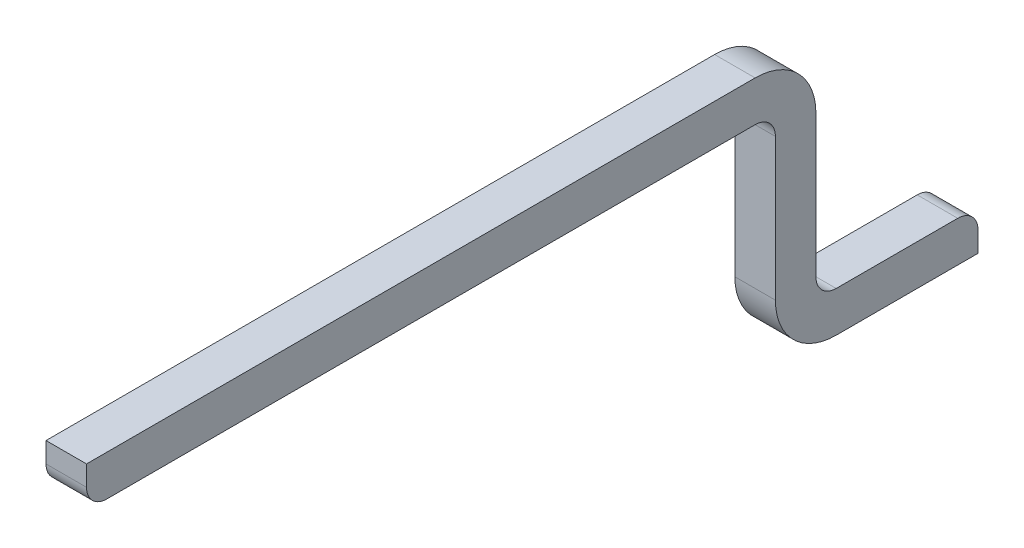
ISO-10303-21;
HEADER;
FILE_DESCRIPTION(('STEP AP214'),'2;1');
FILE_NAME('part.step','',(''),(''),'','','');
FILE_SCHEMA(('AUTOMOTIVE_DESIGN { 1 0 10303 214 1 1 1 1 }'));
ENDSEC;
DATA;
#1=APPLICATION_CONTEXT('core data for automotive mechanical design processes');
#2=APPLICATION_PROTOCOL_DEFINITION('international standard','automotive_design',2000,#1);
#3=PRODUCT_CONTEXT('',#1,'mechanical');
#4=PRODUCT('Part','Part','',(#3));
#5=PRODUCT_RELATED_PRODUCT_CATEGORY('part','',(#4));
#6=PRODUCT_DEFINITION_FORMATION('','',#4);
#7=PRODUCT_DEFINITION_CONTEXT('part definition',#1,'design');
#8=PRODUCT_DEFINITION('design','',#6,#7);
#9=PRODUCT_DEFINITION_SHAPE('','',#8);
#10=(LENGTH_UNIT() NAMED_UNIT(*) SI_UNIT(.MILLI.,.METRE.));
#11=(NAMED_UNIT(*) PLANE_ANGLE_UNIT() SI_UNIT($,.RADIAN.));
#12=(NAMED_UNIT(*) SI_UNIT($,.STERADIAN.) SOLID_ANGLE_UNIT());
#13=UNCERTAINTY_MEASURE_WITH_UNIT(LENGTH_MEASURE(1.E-05),#10,'distance_accuracy_value','');
#14=(GEOMETRIC_REPRESENTATION_CONTEXT(3) GLOBAL_UNCERTAINTY_ASSIGNED_CONTEXT((#13)) GLOBAL_UNIT_ASSIGNED_CONTEXT((#10,
#11,#12)) REPRESENTATION_CONTEXT('',''));
#15=CARTESIAN_POINT('',(0.,0.,0.));
#16=DIRECTION('',(0.,0.,1.));
#17=DIRECTION('',(1.,0.,0.));
#18=AXIS2_PLACEMENT_3D('',#15,#16,#17);
#19=CARTESIAN_POINT('',(0.1,0.,-4.5));
#20=DIRECTION('',(0.,1.,0.));
#21=DIRECTION('',(0.,0.,1.));
#22=AXIS2_PLACEMENT_3D('',#19,#20,#21);
#23=PLANE('',#22);
#24=DIRECTION('',(0.,0.,-1.));
#25=VECTOR('',#24,1.);
#26=CARTESIAN_POINT('',(-0.1,0.,-4.5));
#27=LINE('',#26,#25);
#28=CARTESIAN_POINT('',(-0.1,0.,-4.5));
#29=VERTEX_POINT('',#28);
#30=CARTESIAN_POINT('',(-0.1,0.,-5.2));
#31=VERTEX_POINT('',#30);
#32=EDGE_CURVE('E155',#29,#31,#27,.T.);
#33=ORIENTED_EDGE('',*,*,#32,.T.);
#34=DIRECTION('',(-1.,0.,0.));
#35=VECTOR('',#34,1.);
#36=CARTESIAN_POINT('',(0.1,0.,-5.2));
#37=LINE('',#36,#35);
#38=CARTESIAN_POINT('',(0.1,0.,-5.2));
#39=VERTEX_POINT('',#38);
#40=EDGE_CURVE('E137',#39,#31,#37,.T.);
#41=ORIENTED_EDGE('',*,*,#40,.F.);
#42=DIRECTION('',(0.,0.,-1.));
#43=VECTOR('',#42,1.);
#44=CARTESIAN_POINT('',(0.1,0.,-4.5));
#45=LINE('',#44,#43);
#46=CARTESIAN_POINT('',(0.1,0.,-4.5));
#47=VERTEX_POINT('',#46);
#48=EDGE_CURVE('E143',#47,#39,#45,.T.);
#49=ORIENTED_EDGE('',*,*,#48,.F.);
#50=DIRECTION('',(-1.,0.,0.));
#51=VECTOR('',#50,1.);
#52=CARTESIAN_POINT('',(0.1,0.,-4.5));
#53=LINE('',#52,#51);
#54=EDGE_CURVE('E198',#47,#29,#53,.T.);
#55=ORIENTED_EDGE('',*,*,#54,.T.);
#56=EDGE_LOOP('',(#33,#41,#49,#55));
#57=FACE_BOUND('',#56,.T.);
#58=ADVANCED_FACE('F32',(#57),#23,.F.);
#59=CARTESIAN_POINT('',(0.1,0.2,-5.2));
#60=DIRECTION('',(0.,0.,-1.));
#61=DIRECTION('',(-1.,0.,0.));
#62=AXIS2_PLACEMENT_3D('',#59,#60,#61);
#63=PLANE('',#62);
#64=DIRECTION('',(0.,-1.,0.));
#65=VECTOR('',#64,1.);
#66=CARTESIAN_POINT('',(-0.1,0.2,-5.2));
#67=LINE('',#66,#65);
#68=CARTESIAN_POINT('',(-0.1,0.1,-5.2));
#69=VERTEX_POINT('',#68);
#70=EDGE_CURVE('E268',#69,#31,#67,.T.);
#71=ORIENTED_EDGE('',*,*,#70,.F.);
#72=DIRECTION('',(-1.,0.,0.));
#73=VECTOR('',#72,1.);
#74=CARTESIAN_POINT('',(0.1,0.1,-5.2));
#75=LINE('',#74,#73);
#76=CARTESIAN_POINT('',(0.1,0.1,-5.2));
#77=VERTEX_POINT('',#76);
#78=EDGE_CURVE('E140',#69,#77,#75,.F.);
#79=ORIENTED_EDGE('',*,*,#78,.T.);
#80=DIRECTION('',(0.,-1.,0.));
#81=VECTOR('',#80,1.);
#82=CARTESIAN_POINT('',(0.1,0.2,-5.2));
#83=LINE('',#82,#81);
#84=EDGE_CURVE('E132',#77,#39,#83,.T.);
#85=ORIENTED_EDGE('',*,*,#84,.T.);
#86=ORIENTED_EDGE('',*,*,#40,.T.);
#87=EDGE_LOOP('',(#71,#79,#85,#86));
#88=FACE_BOUND('',#87,.T.);
#89=ADVANCED_FACE('F135',(#88),#63,.T.);
#90=CARTESIAN_POINT('',(0.1,0.2,-4.5));
#91=DIRECTION('',(0.,1.,0.));
#92=DIRECTION('',(0.,0.,1.));
#93=AXIS2_PLACEMENT_3D('',#90,#91,#92);
#94=PLANE('',#93);
#95=DIRECTION('',(0.,0.,-1.));
#96=VECTOR('',#95,1.);
#97=CARTESIAN_POINT('',(0.1,0.2,-4.5));
#98=LINE('',#97,#96);
#99=CARTESIAN_POINT('',(0.1,0.2,-4.5));
#100=VERTEX_POINT('',#99);
#101=CARTESIAN_POINT('',(0.1,0.2,-5.1));
#102=VERTEX_POINT('',#101);
#103=EDGE_CURVE('E142',#100,#102,#98,.T.);
#104=ORIENTED_EDGE('',*,*,#103,.T.);
#105=DIRECTION('',(-1.,0.,0.));
#106=VECTOR('',#105,1.);
#107=CARTESIAN_POINT('',(0.1,0.2,-5.1));
#108=LINE('',#107,#106);
#109=CARTESIAN_POINT('',(-0.1,0.2,-5.1));
#110=VERTEX_POINT('',#109);
#111=EDGE_CURVE('E156',#102,#110,#108,.T.);
#112=ORIENTED_EDGE('',*,*,#111,.T.);
#113=DIRECTION('',(0.,0.,-1.));
#114=VECTOR('',#113,1.);
#115=CARTESIAN_POINT('',(-0.1,0.2,-4.5));
#116=LINE('',#115,#114);
#117=CARTESIAN_POINT('',(-0.1,0.2,-4.5));
#118=VERTEX_POINT('',#117);
#119=EDGE_CURVE('E231',#118,#110,#116,.T.);
#120=ORIENTED_EDGE('',*,*,#119,.F.);
#121=DIRECTION('',(-1.,0.,0.));
#122=VECTOR('',#121,1.);
#123=CARTESIAN_POINT('',(0.1,0.2,-4.5));
#124=LINE('',#123,#122);
#125=EDGE_CURVE('E157',#100,#118,#124,.T.);
#126=ORIENTED_EDGE('',*,*,#125,.F.);
#127=EDGE_LOOP('',(#104,#112,#120,#126));
#128=FACE_BOUND('',#127,.T.);
#129=ADVANCED_FACE('F271',(#128),#94,.T.);
#130=CARTESIAN_POINT('',(0.1,0.3,-4.5));
#131=DIRECTION('',(-1.,0.,0.));
#132=DIRECTION('',(0.,0.,1.));
#133=AXIS2_PLACEMENT_3D('',#130,#131,#132);
#134=CYLINDRICAL_SURFACE('',#133,0.0999999999999999);
#135=CARTESIAN_POINT('',(-0.1,0.3,-4.5));
#136=DIRECTION('',(1.,0.,0.));
#137=DIRECTION('',(0.,0.,-1.));
#138=AXIS2_PLACEMENT_3D('',#135,#136,#137);
#139=CIRCLE('',#138,0.0999999999999999);
#140=CARTESIAN_POINT('',(-0.1,0.3,-4.4));
#141=VERTEX_POINT('',#140);
#142=EDGE_CURVE('E228',#141,#118,#139,.T.);
#143=ORIENTED_EDGE('',*,*,#142,.F.);
#144=DIRECTION('',(-1.,0.,0.));
#145=VECTOR('',#144,1.);
#146=CARTESIAN_POINT('',(0.1,0.3,-4.4));
#147=LINE('',#146,#145);
#148=CARTESIAN_POINT('',(0.1,0.3,-4.4));
#149=VERTEX_POINT('',#148);
#150=EDGE_CURVE('E162',#149,#141,#147,.T.);
#151=ORIENTED_EDGE('',*,*,#150,.F.);
#152=CARTESIAN_POINT('',(0.1,0.3,-4.5));
#153=DIRECTION('',(1.,0.,0.));
#154=DIRECTION('',(0.,0.,-1.));
#155=AXIS2_PLACEMENT_3D('',#152,#153,#154);
#156=CIRCLE('',#155,0.0999999999999999);
#157=EDGE_CURVE('E252',#149,#100,#156,.T.);
#158=ORIENTED_EDGE('',*,*,#157,.T.);
#159=ORIENTED_EDGE('',*,*,#125,.T.);
#160=EDGE_LOOP('',(#143,#151,#158,#159));
#161=FACE_BOUND('',#160,.T.);
#162=ADVANCED_FACE('F229',(#161),#134,.F.);
#163=CARTESIAN_POINT('',(0.1,1.,-4.4));
#164=DIRECTION('',(0.,0.,-1.));
#165=DIRECTION('',(-1.,0.,0.));
#166=AXIS2_PLACEMENT_3D('',#163,#164,#165);
#167=PLANE('',#166);
#168=DIRECTION('',(0.,1.,0.));
#169=VECTOR('',#168,1.);
#170=CARTESIAN_POINT('',(-0.1,1.,-4.4));
#171=LINE('',#170,#169);
#172=CARTESIAN_POINT('',(-0.1,1.,-4.4));
#173=VERTEX_POINT('',#172);
#174=EDGE_CURVE('E220',#173,#141,#171,.F.);
#175=ORIENTED_EDGE('',*,*,#174,.F.);
#176=DIRECTION('',(-1.,0.,0.));
#177=VECTOR('',#176,1.);
#178=CARTESIAN_POINT('',(0.1,1.,-4.4));
#179=LINE('',#178,#177);
#180=CARTESIAN_POINT('',(0.1,1.,-4.4));
#181=VERTEX_POINT('',#180);
#182=EDGE_CURVE('E213',#181,#173,#179,.T.);
#183=ORIENTED_EDGE('',*,*,#182,.F.);
#184=DIRECTION('',(0.,1.,0.));
#185=VECTOR('',#184,1.);
#186=CARTESIAN_POINT('',(0.1,1.,-4.4));
#187=LINE('',#186,#185);
#188=EDGE_CURVE('E223',#181,#149,#187,.F.);
#189=ORIENTED_EDGE('',*,*,#188,.T.);
#190=ORIENTED_EDGE('',*,*,#150,.T.);
#191=EDGE_LOOP('',(#175,#183,#189,#190));
#192=FACE_BOUND('',#191,.T.);
#193=ADVANCED_FACE('F218',(#192),#167,.T.);
#194=CARTESIAN_POINT('',(0.1,1.,-4.1));
#195=DIRECTION('',(-1.,0.,0.));
#196=DIRECTION('',(0.,0.,1.));
#197=AXIS2_PLACEMENT_3D('',#194,#195,#196);
#198=CYLINDRICAL_SURFACE('',#197,0.3);
#199=CARTESIAN_POINT('',(-0.1,1.,-4.1));
#200=DIRECTION('',(1.,0.,0.));
#201=DIRECTION('',(0.,0.,-1.));
#202=AXIS2_PLACEMENT_3D('',#199,#200,#201);
#203=CIRCLE('',#202,0.3);
#204=CARTESIAN_POINT('',(-0.1,1.3,-4.1));
#205=VERTEX_POINT('',#204);
#206=EDGE_CURVE('E235',#205,#173,#203,.F.);
#207=ORIENTED_EDGE('',*,*,#206,.F.);
#208=DIRECTION('',(-1.,0.,0.));
#209=VECTOR('',#208,1.);
#210=CARTESIAN_POINT('',(0.1,1.3,-4.1));
#211=LINE('',#210,#209);
#212=CARTESIAN_POINT('',(0.1,1.3,-4.1));
#213=VERTEX_POINT('',#212);
#214=EDGE_CURVE('E211',#213,#205,#211,.T.);
#215=ORIENTED_EDGE('',*,*,#214,.F.);
#216=CARTESIAN_POINT('',(0.1,1.,-4.1));
#217=DIRECTION('',(1.,0.,0.));
#218=DIRECTION('',(0.,0.,-1.));
#219=AXIS2_PLACEMENT_3D('',#216,#217,#218);
#220=CIRCLE('',#219,0.3);
#221=EDGE_CURVE('E250',#213,#181,#220,.F.);
#222=ORIENTED_EDGE('',*,*,#221,.T.);
#223=ORIENTED_EDGE('',*,*,#182,.T.);
#224=EDGE_LOOP('',(#207,#215,#222,#223));
#225=FACE_BOUND('',#224,.T.);
#226=ADVANCED_FACE('F249',(#225),#198,.T.);
#227=CARTESIAN_POINT('',(0.1,1.3,-0.8));
#228=DIRECTION('',(0.,1.,0.));
#229=DIRECTION('',(0.,0.,1.));
#230=AXIS2_PLACEMENT_3D('',#227,#228,#229);
#231=PLANE('',#230);
#232=DIRECTION('',(0.,0.,-1.));
#233=VECTOR('',#232,1.);
#234=CARTESIAN_POINT('',(-0.1,1.3,-0.8));
#235=LINE('',#234,#233);
#236=CARTESIAN_POINT('',(-0.1,1.3,-0.8));
#237=VERTEX_POINT('',#236);
#238=EDGE_CURVE('E192',#237,#205,#235,.T.);
#239=ORIENTED_EDGE('',*,*,#238,.F.);
#240=DIRECTION('',(-1.,0.,0.));
#241=VECTOR('',#240,1.);
#242=CARTESIAN_POINT('',(0.1,1.3,-0.8));
#243=LINE('',#242,#241);
#244=CARTESIAN_POINT('',(0.1,1.3,-0.8));
#245=VERTEX_POINT('',#244);
#246=EDGE_CURVE('E208',#245,#237,#243,.T.);
#247=ORIENTED_EDGE('',*,*,#246,.F.);
#248=DIRECTION('',(0.,0.,-1.));
#249=VECTOR('',#248,1.);
#250=CARTESIAN_POINT('',(0.1,1.3,-0.8));
#251=LINE('',#250,#249);
#252=EDGE_CURVE('E245',#245,#213,#251,.T.);
#253=ORIENTED_EDGE('',*,*,#252,.T.);
#254=ORIENTED_EDGE('',*,*,#214,.T.);
#255=EDGE_LOOP('',(#239,#247,#253,#254));
#256=FACE_BOUND('',#255,.T.);
#257=ADVANCED_FACE('F242',(#256),#231,.T.);
#258=CARTESIAN_POINT('',(0.1,1.1,-0.8));
#259=DIRECTION('',(0.,0.,1.));
#260=DIRECTION('',(0.,-1.,0.));
#261=AXIS2_PLACEMENT_3D('',#258,#259,#260);
#262=PLANE('',#261);
#263=DIRECTION('',(0.,1.,0.));
#264=VECTOR('',#263,1.);
#265=CARTESIAN_POINT('',(-0.1,1.1,-0.8));
#266=LINE('',#265,#264);
#267=CARTESIAN_POINT('',(-0.1,1.2,-0.8));
#268=VERTEX_POINT('',#267);
#269=EDGE_CURVE('E188',#268,#237,#266,.T.);
#270=ORIENTED_EDGE('',*,*,#269,.F.);
#271=DIRECTION('',(-1.,0.,0.));
#272=VECTOR('',#271,1.);
#273=CARTESIAN_POINT('',(0.1,1.2,-0.8));
#274=LINE('',#273,#272);
#275=CARTESIAN_POINT('',(0.1,1.2,-0.8));
#276=VERTEX_POINT('',#275);
#277=EDGE_CURVE('E11',#268,#276,#274,.F.);
#278=ORIENTED_EDGE('',*,*,#277,.T.);
#279=DIRECTION('',(0.,1.,0.));
#280=VECTOR('',#279,1.);
#281=CARTESIAN_POINT('',(0.1,1.1,-0.8));
#282=LINE('',#281,#280);
#283=EDGE_CURVE('E259',#276,#245,#282,.T.);
#284=ORIENTED_EDGE('',*,*,#283,.T.);
#285=ORIENTED_EDGE('',*,*,#246,.T.);
#286=EDGE_LOOP('',(#270,#278,#284,#285));
#287=FACE_BOUND('',#286,.T.);
#288=ADVANCED_FACE('F298',(#287),#262,.T.);
#289=CARTESIAN_POINT('',(0.1,1.1,-0.8));
#290=DIRECTION('',(0.,1.,0.));
#291=DIRECTION('',(0.,0.,1.));
#292=AXIS2_PLACEMENT_3D('',#289,#290,#291);
#293=PLANE('',#292);
#294=DIRECTION('',(0.,0.,-1.));
#295=VECTOR('',#294,1.);
#296=CARTESIAN_POINT('',(0.1,1.1,-0.8));
#297=LINE('',#296,#295);
#298=CARTESIAN_POINT('',(0.1,1.1,-0.9));
#299=VERTEX_POINT('',#298);
#300=CARTESIAN_POINT('',(0.1,1.1,-4.1));
#301=VERTEX_POINT('',#300);
#302=EDGE_CURVE('E180',#299,#301,#297,.T.);
#303=ORIENTED_EDGE('',*,*,#302,.F.);
#304=DIRECTION('',(-1.,0.,0.));
#305=VECTOR('',#304,1.);
#306=CARTESIAN_POINT('',(-0.1,1.1,-0.9));
#307=LINE('',#306,#305);
#308=CARTESIAN_POINT('',(-0.1,1.1,-0.9));
#309=VERTEX_POINT('',#308);
#310=EDGE_CURVE('E40',#299,#309,#307,.T.);
#311=ORIENTED_EDGE('',*,*,#310,.T.);
#312=DIRECTION('',(0.,0.,-1.));
#313=VECTOR('',#312,1.);
#314=CARTESIAN_POINT('',(-0.1,1.1,-0.8));
#315=LINE('',#314,#313);
#316=CARTESIAN_POINT('',(-0.1,1.1,-4.1));
#317=VERTEX_POINT('',#316);
#318=EDGE_CURVE('E178',#309,#317,#315,.T.);
#319=ORIENTED_EDGE('',*,*,#318,.T.);
#320=DIRECTION('',(-1.,0.,0.));
#321=VECTOR('',#320,1.);
#322=CARTESIAN_POINT('',(0.1,1.1,-4.1));
#323=LINE('',#322,#321);
#324=EDGE_CURVE('E206',#301,#317,#323,.T.);
#325=ORIENTED_EDGE('',*,*,#324,.F.);
#326=EDGE_LOOP('',(#303,#311,#319,#325));
#327=FACE_BOUND('',#326,.T.);
#328=ADVANCED_FACE('F176',(#327),#293,.F.);
#329=CARTESIAN_POINT('',(0.1,1.,-4.1));
#330=DIRECTION('',(-1.,0.,0.));
#331=DIRECTION('',(0.,0.,1.));
#332=AXIS2_PLACEMENT_3D('',#329,#330,#331);
#333=CYLINDRICAL_SURFACE('',#332,0.1);
#334=CARTESIAN_POINT('',(-0.1,1.,-4.1));
#335=DIRECTION('',(-1.,0.,0.));
#336=DIRECTION('',(0.,0.,1.));
#337=AXIS2_PLACEMENT_3D('',#334,#335,#336);
#338=CIRCLE('',#337,0.1);
#339=CARTESIAN_POINT('',(-0.1,1.,-4.2));
#340=VERTEX_POINT('',#339);
#341=EDGE_CURVE('E187',#317,#340,#338,.T.);
#342=ORIENTED_EDGE('',*,*,#341,.T.);
#343=DIRECTION('',(-1.,0.,0.));
#344=VECTOR('',#343,1.);
#345=CARTESIAN_POINT('',(0.1,1.,-4.2));
#346=LINE('',#345,#344);
#347=CARTESIAN_POINT('',(0.1,1.,-4.2));
#348=VERTEX_POINT('',#347);
#349=EDGE_CURVE('E203',#348,#340,#346,.T.);
#350=ORIENTED_EDGE('',*,*,#349,.F.);
#351=CARTESIAN_POINT('',(0.1,1.,-4.1));
#352=DIRECTION('',(-1.,0.,0.));
#353=DIRECTION('',(0.,0.,1.));
#354=AXIS2_PLACEMENT_3D('',#351,#352,#353);
#355=CIRCLE('',#354,0.1);
#356=EDGE_CURVE('E262',#301,#348,#355,.T.);
#357=ORIENTED_EDGE('',*,*,#356,.F.);
#358=ORIENTED_EDGE('',*,*,#324,.T.);
#359=EDGE_LOOP('',(#342,#350,#357,#358));
#360=FACE_BOUND('',#359,.T.);
#361=ADVANCED_FACE('F303',(#360),#333,.F.);
#362=CARTESIAN_POINT('',(0.1,1.,-4.2));
#363=DIRECTION('',(0.,0.,-1.));
#364=DIRECTION('',(-1.,0.,0.));
#365=AXIS2_PLACEMENT_3D('',#362,#363,#364);
#366=PLANE('',#365);
#367=DIRECTION('',(0.,-1.,0.));
#368=VECTOR('',#367,1.);
#369=CARTESIAN_POINT('',(-0.1,1.,-4.2));
#370=LINE('',#369,#368);
#371=CARTESIAN_POINT('',(-0.1,0.3,-4.2));
#372=VERTEX_POINT('',#371);
#373=EDGE_CURVE('E190',#340,#372,#370,.T.);
#374=ORIENTED_EDGE('',*,*,#373,.T.);
#375=DIRECTION('',(-1.,0.,0.));
#376=VECTOR('',#375,1.);
#377=CARTESIAN_POINT('',(0.1,0.3,-4.2));
#378=LINE('',#377,#376);
#379=CARTESIAN_POINT('',(0.1,0.3,-4.2));
#380=VERTEX_POINT('',#379);
#381=EDGE_CURVE('E200',#380,#372,#378,.T.);
#382=ORIENTED_EDGE('',*,*,#381,.F.);
#383=DIRECTION('',(0.,-1.,0.));
#384=VECTOR('',#383,1.);
#385=CARTESIAN_POINT('',(0.1,1.,-4.2));
#386=LINE('',#385,#384);
#387=EDGE_CURVE('E264',#348,#380,#386,.T.);
#388=ORIENTED_EDGE('',*,*,#387,.F.);
#389=ORIENTED_EDGE('',*,*,#349,.T.);
#390=EDGE_LOOP('',(#374,#382,#388,#389));
#391=FACE_BOUND('',#390,.T.);
#392=ADVANCED_FACE('F306',(#391),#366,.F.);
#393=CARTESIAN_POINT('',(0.1,0.3,-4.5));
#394=DIRECTION('',(-1.,0.,0.));
#395=DIRECTION('',(0.,0.,1.));
#396=AXIS2_PLACEMENT_3D('',#393,#394,#395);
#397=CYLINDRICAL_SURFACE('',#396,0.3);
#398=CARTESIAN_POINT('',(-0.1,0.3,-4.5));
#399=DIRECTION('',(1.,0.,0.));
#400=DIRECTION('',(0.,0.,-1.));
#401=AXIS2_PLACEMENT_3D('',#398,#399,#400);
#402=CIRCLE('',#401,0.3);
#403=EDGE_CURVE('E152',#372,#29,#402,.T.);
#404=ORIENTED_EDGE('',*,*,#403,.T.);
#405=ORIENTED_EDGE('',*,*,#54,.F.);
#406=CARTESIAN_POINT('',(0.1,0.3,-4.5));
#407=DIRECTION('',(1.,0.,0.));
#408=DIRECTION('',(0.,0.,-1.));
#409=AXIS2_PLACEMENT_3D('',#406,#407,#408);
#410=CIRCLE('',#409,0.3);
#411=EDGE_CURVE('E148',#380,#47,#410,.T.);
#412=ORIENTED_EDGE('',*,*,#411,.F.);
#413=ORIENTED_EDGE('',*,*,#381,.T.);
#414=EDGE_LOOP('',(#404,#405,#412,#413));
#415=FACE_BOUND('',#414,.T.);
#416=ADVANCED_FACE('F310',(#415),#397,.T.);
#417=CARTESIAN_POINT('',(0.1,0.3,-4.5));
#418=DIRECTION('',(1.,0.,0.));
#419=DIRECTION('',(0.,0.,-1.));
#420=AXIS2_PLACEMENT_3D('',#417,#418,#419);
#421=PLANE('',#420);
#422=ORIENTED_EDGE('',*,*,#84,.F.);
#423=CARTESIAN_POINT('',(0.1,0.1,-5.1));
#424=DIRECTION('',(1.,0.,0.));
#425=DIRECTION('',(0.,0.,-1.));
#426=AXIS2_PLACEMENT_3D('',#423,#424,#425);
#427=CIRCLE('',#426,0.1);
#428=EDGE_CURVE('E171',#77,#102,#427,.T.);
#429=ORIENTED_EDGE('',*,*,#428,.T.);
#430=ORIENTED_EDGE('',*,*,#103,.F.);
#431=ORIENTED_EDGE('',*,*,#157,.F.);
#432=ORIENTED_EDGE('',*,*,#188,.F.);
#433=ORIENTED_EDGE('',*,*,#221,.F.);
#434=ORIENTED_EDGE('',*,*,#252,.F.);
#435=ORIENTED_EDGE('',*,*,#283,.F.);
#436=CARTESIAN_POINT('',(0.1,1.2,-0.9));
#437=DIRECTION('',(1.,0.,0.));
#438=DIRECTION('',(0.,0.,-1.));
#439=AXIS2_PLACEMENT_3D('',#436,#437,#438);
#440=CIRCLE('',#439,0.1);
#441=EDGE_CURVE('E47',#276,#299,#440,.T.);
#442=ORIENTED_EDGE('',*,*,#441,.T.);
#443=ORIENTED_EDGE('',*,*,#302,.T.);
#444=ORIENTED_EDGE('',*,*,#356,.T.);
#445=ORIENTED_EDGE('',*,*,#387,.T.);
#446=ORIENTED_EDGE('',*,*,#411,.T.);
#447=ORIENTED_EDGE('',*,*,#48,.T.);
#448=EDGE_LOOP('',(#422,#429,#430,#431,#432,#433,#434,#435,#442,#443,#444,#445,#446,#447));
#449=FACE_BOUND('',#448,.T.);
#450=ADVANCED_FACE('F146',(#449),#421,.T.);
#451=CARTESIAN_POINT('',(-0.1,0.3,-4.5));
#452=DIRECTION('',(1.,0.,0.));
#453=DIRECTION('',(0.,0.,-1.));
#454=AXIS2_PLACEMENT_3D('',#451,#452,#453);
#455=PLANE('',#454);
#456=ORIENTED_EDGE('',*,*,#119,.T.);
#457=CARTESIAN_POINT('',(-0.1,0.1,-5.1));
#458=DIRECTION('',(1.,0.,0.));
#459=DIRECTION('',(0.,0.,-1.));
#460=AXIS2_PLACEMENT_3D('',#457,#458,#459);
#461=CIRCLE('',#460,0.1);
#462=EDGE_CURVE('E167',#110,#69,#461,.F.);
#463=ORIENTED_EDGE('',*,*,#462,.T.);
#464=ORIENTED_EDGE('',*,*,#70,.T.);
#465=ORIENTED_EDGE('',*,*,#32,.F.);
#466=ORIENTED_EDGE('',*,*,#403,.F.);
#467=ORIENTED_EDGE('',*,*,#373,.F.);
#468=ORIENTED_EDGE('',*,*,#341,.F.);
#469=ORIENTED_EDGE('',*,*,#318,.F.);
#470=CARTESIAN_POINT('',(-0.1,1.2,-0.9));
#471=DIRECTION('',(1.,0.,0.));
#472=DIRECTION('',(0.,0.,-1.));
#473=AXIS2_PLACEMENT_3D('',#470,#471,#472);
#474=CIRCLE('',#473,0.1);
#475=EDGE_CURVE('E160',#309,#268,#474,.F.);
#476=ORIENTED_EDGE('',*,*,#475,.T.);
#477=ORIENTED_EDGE('',*,*,#269,.T.);
#478=ORIENTED_EDGE('',*,*,#238,.T.);
#479=ORIENTED_EDGE('',*,*,#206,.T.);
#480=ORIENTED_EDGE('',*,*,#174,.T.);
#481=ORIENTED_EDGE('',*,*,#142,.T.);
#482=EDGE_LOOP('',(#456,#463,#464,#465,#466,#467,#468,#469,#476,#477,#478,#479,#480,#481));
#483=FACE_BOUND('',#482,.T.);
#484=ADVANCED_FACE('F185',(#483),#455,.F.);
#485=CARTESIAN_POINT('',(0.1,0.1,-5.1));
#486=DIRECTION('',(-1.,0.,0.));
#487=DIRECTION('',(0.,0.,1.));
#488=AXIS2_PLACEMENT_3D('',#485,#486,#487);
#489=CYLINDRICAL_SURFACE('',#488,0.1);
#490=ORIENTED_EDGE('',*,*,#428,.F.);
#491=ORIENTED_EDGE('',*,*,#78,.F.);
#492=ORIENTED_EDGE('',*,*,#462,.F.);
#493=ORIENTED_EDGE('',*,*,#111,.F.);
#494=EDGE_LOOP('',(#490,#491,#492,#493));
#495=FACE_BOUND('',#494,.T.);
#496=ADVANCED_FACE('F274',(#495),#489,.T.);
#497=CARTESIAN_POINT('',(0.1,1.2,-0.9));
#498=DIRECTION('',(1.,0.,0.));
#499=DIRECTION('',(0.,0.,-1.));
#500=AXIS2_PLACEMENT_3D('',#497,#498,#499);
#501=CYLINDRICAL_SURFACE('',#500,0.1);
#502=ORIENTED_EDGE('',*,*,#441,.F.);
#503=ORIENTED_EDGE('',*,*,#277,.F.);
#504=ORIENTED_EDGE('',*,*,#475,.F.);
#505=ORIENTED_EDGE('',*,*,#310,.F.);
#506=EDGE_LOOP('',(#502,#503,#504,#505));
#507=FACE_BOUND('',#506,.T.);
#508=ADVANCED_FACE('F34',(#507),#501,.T.);
#509=CLOSED_SHELL('',(#58,#89,#129,#162,#193,#226,#257,#288,#328,#361,#392,#416,#450,#484,#496,#508));
#510=MANIFOLD_SOLID_BREP('B2',#509);
#511=ADVANCED_BREP_SHAPE_REPRESENTATION('',(#18,#510),#14);
#512=SHAPE_DEFINITION_REPRESENTATION(#9,#511);
ENDSEC;
END-ISO-10303-21;
